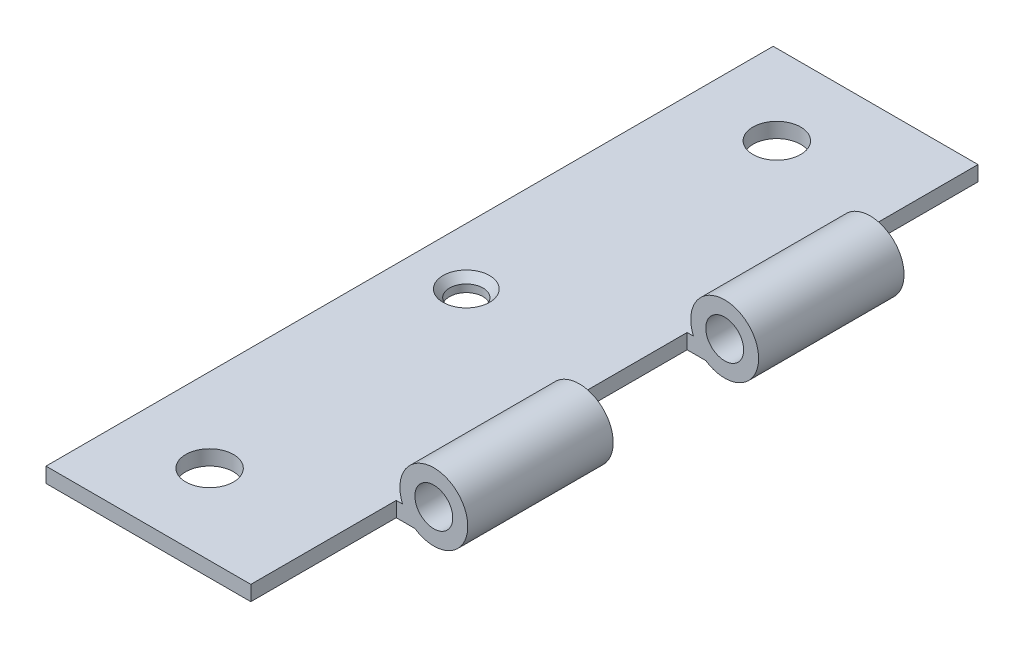
ISO-10303-21;
HEADER;
FILE_DESCRIPTION(('STEP AP214'),'2;1');
FILE_NAME('part.step','',(''),(''),'','','');
FILE_SCHEMA(('AUTOMOTIVE_DESIGN { 1 0 10303 214 1 1 1 1 }'));
ENDSEC;
DATA;
#1=APPLICATION_CONTEXT('core data for automotive mechanical design processes');
#2=APPLICATION_PROTOCOL_DEFINITION('international standard','automotive_design',2000,#1);
#3=PRODUCT_CONTEXT('',#1,'mechanical');
#4=PRODUCT('Part','Part','',(#3));
#5=PRODUCT_RELATED_PRODUCT_CATEGORY('part','',(#4));
#6=PRODUCT_DEFINITION_FORMATION('','',#4);
#7=PRODUCT_DEFINITION_CONTEXT('part definition',#1,'design');
#8=PRODUCT_DEFINITION('design','',#6,#7);
#9=PRODUCT_DEFINITION_SHAPE('','',#8);
#10=(LENGTH_UNIT() NAMED_UNIT(*) SI_UNIT(.MILLI.,.METRE.));
#11=(NAMED_UNIT(*) PLANE_ANGLE_UNIT() SI_UNIT($,.RADIAN.));
#12=(NAMED_UNIT(*) SI_UNIT($,.STERADIAN.) SOLID_ANGLE_UNIT());
#13=UNCERTAINTY_MEASURE_WITH_UNIT(LENGTH_MEASURE(1.E-05),#10,'distance_accuracy_value','');
#14=(GEOMETRIC_REPRESENTATION_CONTEXT(3) GLOBAL_UNCERTAINTY_ASSIGNED_CONTEXT((#13)) GLOBAL_UNIT_ASSIGNED_CONTEXT((#10,
#11,#12)) REPRESENTATION_CONTEXT('',''));
#15=CARTESIAN_POINT('',(0.,0.,0.));
#16=DIRECTION('',(0.,0.,1.));
#17=DIRECTION('',(1.,0.,0.));
#18=AXIS2_PLACEMENT_3D('',#15,#16,#17);
#19=CARTESIAN_POINT('',(0.,0.,-22.86));
#20=DIRECTION('',(0.,0.,1.));
#21=DIRECTION('',(1.,0.,0.));
#22=AXIS2_PLACEMENT_3D('',#19,#20,#21);
#23=PLANE('',#22);
#24=CARTESIAN_POINT('',(0.,0.,-22.86));
#25=DIRECTION('',(0.,0.,-1.));
#26=DIRECTION('',(-1.,0.,0.));
#27=AXIS2_PLACEMENT_3D('',#24,#25,#26);
#28=CIRCLE('',#27,1.98437499999999);
#29=CARTESIAN_POINT('',(-1.98437499999999,0.,-22.86));
#30=VERTEX_POINT('',#29);
#31=EDGE_CURVE('E246',#30,#30,#28,.T.);
#32=ORIENTED_EDGE('',*,*,#31,.F.);
#33=EDGE_LOOP('',(#32));
#34=FACE_BOUND('',#33,.T.);
#35=DIRECTION('',(0.,-1.,0.));
#36=VECTOR('',#35,1.);
#37=CARTESIAN_POINT('',(-3.937,-2.95082901222268,-22.86));
#38=LINE('',#37,#36);
#39=CARTESIAN_POINT('',(-3.937,-1.37602901222267,-22.86));
#40=VERTEX_POINT('',#39);
#41=CARTESIAN_POINT('',(-3.937,-2.95082901222268,-22.86));
#42=VERTEX_POINT('',#41);
#43=EDGE_CURVE('E49',#40,#42,#38,.T.);
#44=ORIENTED_EDGE('',*,*,#43,.F.);
#45=DIRECTION('',(1.,0.,0.));
#46=VECTOR('',#45,1.);
#47=CARTESIAN_POINT('',(-3.53362245835359,-1.37602901222267,-22.86));
#48=LINE('',#47,#46);
#49=CARTESIAN_POINT('',(-3.27897547376029,-1.37602901222267,-22.86));
#50=VERTEX_POINT('',#49);
#51=EDGE_CURVE('E145',#40,#50,#48,.T.);
#52=ORIENTED_EDGE('',*,*,#51,.T.);
#53=CARTESIAN_POINT('',(0.,0.,-22.86));
#54=DIRECTION('',(0.,0.,1.));
#55=DIRECTION('',(1.,0.,0.));
#56=AXIS2_PLACEMENT_3D('',#53,#54,#55);
#57=CIRCLE('',#56,3.556);
#58=CARTESIAN_POINT('',(-1.984375,-2.95082901222266,-22.86));
#59=VERTEX_POINT('',#58);
#60=EDGE_CURVE('E194',#59,#50,#57,.T.);
#61=ORIENTED_EDGE('',*,*,#60,.F.);
#62=DIRECTION('',(1.,0.,0.));
#63=VECTOR('',#62,1.);
#64=CARTESIAN_POINT('',(-3.27897547376029,-2.95082901222268,-22.86));
#65=LINE('',#64,#63);
#66=EDGE_CURVE('E192',#42,#59,#65,.T.);
#67=ORIENTED_EDGE('',*,*,#66,.F.);
#68=EDGE_LOOP('',(#44,#52,#61,#67));
#69=FACE_BOUND('',#68,.T.);
#70=ADVANCED_FACE('F32',(#34,#69),#23,.F.);
#71=CARTESIAN_POINT('',(0.,0.,22.86));
#72=DIRECTION('',(0.,0.,-1.));
#73=DIRECTION('',(-1.,0.,0.));
#74=AXIS2_PLACEMENT_3D('',#71,#72,#73);
#75=PLANE('',#74);
#76=CARTESIAN_POINT('',(0.,0.,22.86));
#77=DIRECTION('',(0.,0.,-1.));
#78=DIRECTION('',(-1.,0.,0.));
#79=AXIS2_PLACEMENT_3D('',#76,#77,#78);
#80=CIRCLE('',#79,1.98437499999999);
#81=CARTESIAN_POINT('',(-1.98437499999999,0.,22.86));
#82=VERTEX_POINT('',#81);
#83=EDGE_CURVE('E156',#82,#82,#80,.T.);
#84=ORIENTED_EDGE('',*,*,#83,.T.);
#85=EDGE_LOOP('',(#84));
#86=FACE_BOUND('',#85,.T.);
#87=DIRECTION('',(0.,1.,0.));
#88=VECTOR('',#87,1.);
#89=CARTESIAN_POINT('',(-3.937,-1.37602901222267,22.86));
#90=LINE('',#89,#88);
#91=CARTESIAN_POINT('',(-3.937,-2.95082901222267,22.86));
#92=VERTEX_POINT('',#91);
#93=CARTESIAN_POINT('',(-3.937,-1.37602901222267,22.86));
#94=VERTEX_POINT('',#93);
#95=EDGE_CURVE('E57',#92,#94,#90,.T.);
#96=ORIENTED_EDGE('',*,*,#95,.F.);
#97=DIRECTION('',(1.,0.,0.));
#98=VECTOR('',#97,1.);
#99=CARTESIAN_POINT('',(-1.984375,-2.95082901222266,22.86));
#100=LINE('',#99,#98);
#101=CARTESIAN_POINT('',(-1.984375,-2.95082901222267,22.86));
#102=VERTEX_POINT('',#101);
#103=EDGE_CURVE('E535',#92,#102,#100,.T.);
#104=ORIENTED_EDGE('',*,*,#103,.T.);
#105=CARTESIAN_POINT('',(0.,0.,22.86));
#106=DIRECTION('',(0.,0.,1.));
#107=DIRECTION('',(-1.,0.,0.));
#108=AXIS2_PLACEMENT_3D('',#105,#106,#107);
#109=CIRCLE('',#108,3.556);
#110=CARTESIAN_POINT('',(-3.27897547376029,-1.37602901222267,22.86));
#111=VERTEX_POINT('',#110);
#112=EDGE_CURVE('E536',#102,#111,#109,.T.);
#113=ORIENTED_EDGE('',*,*,#112,.T.);
#114=DIRECTION('',(-1.,0.,0.));
#115=VECTOR('',#114,1.);
#116=CARTESIAN_POINT('',(-25.4,-1.37602901222267,22.86));
#117=LINE('',#116,#115);
#118=EDGE_CURVE('E180',#111,#94,#117,.T.);
#119=ORIENTED_EDGE('',*,*,#118,.T.);
#120=EDGE_LOOP('',(#96,#104,#113,#119));
#121=FACE_BOUND('',#120,.T.);
#122=ADVANCED_FACE('F297',(#86,#121),#75,.F.);
#123=CARTESIAN_POINT('',(0.,0.,-22.86));
#124=DIRECTION('',(0.,0.,1.));
#125=DIRECTION('',(1.,0.,0.));
#126=AXIS2_PLACEMENT_3D('',#123,#124,#125);
#127=CYLINDRICAL_SURFACE('',#126,3.556);
#128=CARTESIAN_POINT('',(0.,0.,-7.62));
#129=DIRECTION('',(0.,0.,1.));
#130=DIRECTION('',(1.,0.,0.));
#131=AXIS2_PLACEMENT_3D('',#128,#129,#130);
#132=CIRCLE('',#131,3.556);
#133=CARTESIAN_POINT('',(-1.984375,-2.95082901222266,-7.62));
#134=VERTEX_POINT('',#133);
#135=CARTESIAN_POINT('',(-3.27897547376029,-1.37602901222267,-7.61999999999999));
#136=VERTEX_POINT('',#135);
#137=EDGE_CURVE('E198',#134,#136,#132,.T.);
#138=ORIENTED_EDGE('',*,*,#137,.F.);
#139=DIRECTION('',(0.,0.,1.));
#140=VECTOR('',#139,1.);
#141=CARTESIAN_POINT('',(-1.984375,-2.95082901222266,-22.86));
#142=LINE('',#141,#140);
#143=EDGE_CURVE('E11',#59,#134,#142,.T.);
#144=ORIENTED_EDGE('',*,*,#143,.F.);
#145=ORIENTED_EDGE('',*,*,#60,.T.);
#146=DIRECTION('',(0.,0.,1.));
#147=VECTOR('',#146,1.);
#148=CARTESIAN_POINT('',(-3.27897547376029,-1.37602901222267,-22.86));
#149=LINE('',#148,#147);
#150=EDGE_CURVE('E41',#50,#136,#149,.T.);
#151=ORIENTED_EDGE('',*,*,#150,.T.);
#152=EDGE_LOOP('',(#138,#144,#145,#151));
#153=FACE_BOUND('',#152,.T.);
#154=ADVANCED_FACE('F34',(#153),#127,.T.);
#155=CARTESIAN_POINT('',(-3.27897547376029,-2.95082901222268,-22.86));
#156=DIRECTION('',(0.,-1.,0.));
#157=DIRECTION('',(1.,0.,0.));
#158=AXIS2_PLACEMENT_3D('',#155,#156,#157);
#159=PLANE('',#158);
#160=CARTESIAN_POINT('',(-16.637,-2.95082901222278,29.718));
#161=DIRECTION('',(0.,-1.,0.));
#162=DIRECTION('',(1.,0.,0.));
#163=AXIS2_PLACEMENT_3D('',#160,#161,#162);
#164=CIRCLE('',#163,2.5);
#165=CARTESIAN_POINT('',(-14.137,-2.95082901222276,29.718));
#166=VERTEX_POINT('',#165);
#167=EDGE_CURVE('E261',#166,#166,#164,.F.);
#168=ORIENTED_EDGE('',*,*,#167,.T.);
#169=EDGE_LOOP('',(#168));
#170=FACE_BOUND('',#169,.T.);
#171=CARTESIAN_POINT('',(-16.637,-2.95082901222278,-29.718));
#172=DIRECTION('',(0.,-1.,0.));
#173=DIRECTION('',(1.,0.,0.));
#174=AXIS2_PLACEMENT_3D('',#171,#172,#173);
#175=CIRCLE('',#174,2.5);
#176=CARTESIAN_POINT('',(-14.137,-2.95082901222276,-29.718));
#177=VERTEX_POINT('',#176);
#178=EDGE_CURVE('E255',#177,#177,#175,.F.);
#179=ORIENTED_EDGE('',*,*,#178,.T.);
#180=EDGE_LOOP('',(#179));
#181=FACE_BOUND('',#180,.T.);
#182=CARTESIAN_POINT('',(-19.4564,-2.9508290122228,0.));
#183=DIRECTION('',(0.,-1.,0.));
#184=DIRECTION('',(1.,0.,0.));
#185=AXIS2_PLACEMENT_3D('',#182,#183,#184);
#186=CIRCLE('',#185,1.75259999999999);
#187=CARTESIAN_POINT('',(-17.7038,-2.95082901222279,0.));
#188=VERTEX_POINT('',#187);
#189=EDGE_CURVE('E36',#188,#188,#186,.T.);
#190=ORIENTED_EDGE('',*,*,#189,.F.);
#191=EDGE_LOOP('',(#190));
#192=FACE_BOUND('',#191,.T.);
#193=DIRECTION('',(1.,0.,0.));
#194=VECTOR('',#193,1.);
#195=CARTESIAN_POINT('',(-3.27897547376029,-2.95082901222268,-7.62));
#196=LINE('',#195,#194);
#197=CARTESIAN_POINT('',(-3.937,-2.95082901222268,-7.62));
#198=VERTEX_POINT('',#197);
#199=EDGE_CURVE('E201',#198,#134,#196,.T.);
#200=ORIENTED_EDGE('',*,*,#199,.F.);
#201=DIRECTION('',(0.,0.,-1.));
#202=VECTOR('',#201,1.);
#203=CARTESIAN_POINT('',(-3.937,-2.95082901222268,7.62));
#204=LINE('',#203,#202);
#205=CARTESIAN_POINT('',(-3.937,-2.95082901222268,7.62));
#206=VERTEX_POINT('',#205);
#207=EDGE_CURVE('E210',#206,#198,#204,.T.);
#208=ORIENTED_EDGE('',*,*,#207,.F.);
#209=DIRECTION('',(1.,0.,0.));
#210=VECTOR('',#209,1.);
#211=CARTESIAN_POINT('',(-1.984375,-2.95082901222266,7.62));
#212=LINE('',#211,#210);
#213=CARTESIAN_POINT('',(-1.984375,-2.95082901222267,7.62));
#214=VERTEX_POINT('',#213);
#215=EDGE_CURVE('E190',#206,#214,#212,.T.);
#216=ORIENTED_EDGE('',*,*,#215,.T.);
#217=DIRECTION('',(0.,0.,-1.));
#218=VECTOR('',#217,1.);
#219=CARTESIAN_POINT('',(-1.984375,-2.95082901222267,22.86));
#220=LINE('',#219,#218);
#221=EDGE_CURVE('E527',#102,#214,#220,.T.);
#222=ORIENTED_EDGE('',*,*,#221,.F.);
#223=ORIENTED_EDGE('',*,*,#103,.F.);
#224=DIRECTION('',(0.,0.,-1.));
#225=VECTOR('',#224,1.);
#226=CARTESIAN_POINT('',(-3.937,-2.95082901222268,38.1));
#227=LINE('',#226,#225);
#228=CARTESIAN_POINT('',(-3.937,-2.95082901222268,38.1));
#229=VERTEX_POINT('',#228);
#230=EDGE_CURVE('E185',#229,#92,#227,.T.);
#231=ORIENTED_EDGE('',*,*,#230,.F.);
#232=DIRECTION('',(1.,0.,0.));
#233=VECTOR('',#232,1.);
#234=CARTESIAN_POINT('',(-3.937,-2.95082901222268,38.1));
#235=LINE('',#234,#233);
#236=CARTESIAN_POINT('',(-25.4,-2.95082901222268,38.1));
#237=VERTEX_POINT('',#236);
#238=EDGE_CURVE('E147',#237,#229,#235,.T.);
#239=ORIENTED_EDGE('',*,*,#238,.F.);
#240=DIRECTION('',(0.,0.,1.));
#241=VECTOR('',#240,1.);
#242=CARTESIAN_POINT('',(-25.4,-2.95082901222268,7.62));
#243=LINE('',#242,#241);
#244=CARTESIAN_POINT('',(-25.4,-2.95082901222268,-38.1));
#245=VERTEX_POINT('',#244);
#246=EDGE_CURVE('E223',#245,#237,#243,.T.);
#247=ORIENTED_EDGE('',*,*,#246,.F.);
#248=DIRECTION('',(-1.,0.,0.));
#249=VECTOR('',#248,1.);
#250=CARTESIAN_POINT('',(-25.4,-2.95082901222268,-38.1));
#251=LINE('',#250,#249);
#252=CARTESIAN_POINT('',(-3.937,-2.95082901222268,-38.1));
#253=VERTEX_POINT('',#252);
#254=EDGE_CURVE('E132',#253,#245,#251,.T.);
#255=ORIENTED_EDGE('',*,*,#254,.F.);
#256=DIRECTION('',(0.,0.,1.));
#257=VECTOR('',#256,1.);
#258=CARTESIAN_POINT('',(-3.937,-2.95082901222268,-38.1));
#259=LINE('',#258,#257);
#260=EDGE_CURVE('E128',#253,#42,#259,.T.);
#261=ORIENTED_EDGE('',*,*,#260,.T.);
#262=ORIENTED_EDGE('',*,*,#66,.T.);
#263=ORIENTED_EDGE('',*,*,#143,.T.);
#264=EDGE_LOOP('',(#200,#208,#216,#222,#223,#231,#239,#247,#255,#261,#262,#263));
#265=FACE_BOUND('',#264,.T.);
#266=ADVANCED_FACE('F233',(#170,#181,#192,#265),#159,.T.);
#267=CARTESIAN_POINT('',(0.,0.,-7.62));
#268=DIRECTION('',(0.,0.,1.));
#269=DIRECTION('',(1.,0.,0.));
#270=AXIS2_PLACEMENT_3D('',#267,#268,#269);
#271=PLANE('',#270);
#272=CARTESIAN_POINT('',(0.,0.,-7.62));
#273=DIRECTION('',(0.,0.,1.));
#274=DIRECTION('',(1.,0.,0.));
#275=AXIS2_PLACEMENT_3D('',#272,#273,#274);
#276=CIRCLE('',#275,1.98437499999998);
#277=CARTESIAN_POINT('',(1.98437499999998,0.,-7.62));
#278=VERTEX_POINT('',#277);
#279=EDGE_CURVE('E243',#278,#278,#276,.T.);
#280=ORIENTED_EDGE('',*,*,#279,.F.);
#281=EDGE_LOOP('',(#280));
#282=FACE_BOUND('',#281,.T.);
#283=ORIENTED_EDGE('',*,*,#137,.T.);
#284=DIRECTION('',(1.,0.,0.));
#285=VECTOR('',#284,1.);
#286=CARTESIAN_POINT('',(-3.53362245835359,-1.37602901222267,-7.61999999999999));
#287=LINE('',#286,#285);
#288=CARTESIAN_POINT('',(-3.937,-1.37602901222267,-7.62));
#289=VERTEX_POINT('',#288);
#290=EDGE_CURVE('E225',#289,#136,#287,.T.);
#291=ORIENTED_EDGE('',*,*,#290,.F.);
#292=DIRECTION('',(0.,1.,0.));
#293=VECTOR('',#292,1.);
#294=CARTESIAN_POINT('',(-3.937,-2.95082901222268,-7.62));
#295=LINE('',#294,#293);
#296=EDGE_CURVE('E218',#198,#289,#295,.T.);
#297=ORIENTED_EDGE('',*,*,#296,.F.);
#298=ORIENTED_EDGE('',*,*,#199,.T.);
#299=EDGE_LOOP('',(#283,#291,#297,#298));
#300=FACE_BOUND('',#299,.T.);
#301=ADVANCED_FACE('F274',(#282,#300),#271,.T.);
#302=CARTESIAN_POINT('',(-3.53362245835359,-1.37602901222267,-22.86));
#303=DIRECTION('',(0.,-1.,0.));
#304=DIRECTION('',(0.,0.,-1.));
#305=AXIS2_PLACEMENT_3D('',#302,#303,#304);
#306=PLANE('',#305);
#307=CARTESIAN_POINT('',(-16.637,-1.37602901222268,29.718));
#308=DIRECTION('',(0.,1.,0.));
#309=DIRECTION('',(0.,0.,1.));
#310=AXIS2_PLACEMENT_3D('',#307,#308,#309);
#311=CIRCLE('',#310,2.5);
#312=CARTESIAN_POINT('',(-16.637,-1.37602901222268,32.218));
#313=VERTEX_POINT('',#312);
#314=EDGE_CURVE('E264',#313,#313,#311,.T.);
#315=ORIENTED_EDGE('',*,*,#314,.F.);
#316=EDGE_LOOP('',(#315));
#317=FACE_BOUND('',#316,.T.);
#318=CARTESIAN_POINT('',(-16.637,-1.37602901222267,-29.718));
#319=DIRECTION('',(0.,1.,0.));
#320=DIRECTION('',(0.,0.,1.));
#321=AXIS2_PLACEMENT_3D('',#318,#319,#320);
#322=CIRCLE('',#321,2.5);
#323=CARTESIAN_POINT('',(-16.637,-1.37602901222267,-27.218));
#324=VERTEX_POINT('',#323);
#325=EDGE_CURVE('E258',#324,#324,#322,.T.);
#326=ORIENTED_EDGE('',*,*,#325,.F.);
#327=EDGE_LOOP('',(#326));
#328=FACE_BOUND('',#327,.T.);
#329=CARTESIAN_POINT('',(-19.4564,-1.37602901222267,0.));
#330=DIRECTION('',(0.,1.,0.));
#331=DIRECTION('',(0.,0.,1.));
#332=AXIS2_PLACEMENT_3D('',#329,#330,#331);
#333=CIRCLE('',#332,2.4370763773565);
#334=CARTESIAN_POINT('',(-19.4564,-1.37602901222267,2.4370763773565));
#335=VERTEX_POINT('',#334);
#336=EDGE_CURVE('E252',#335,#335,#333,.T.);
#337=ORIENTED_EDGE('',*,*,#336,.F.);
#338=EDGE_LOOP('',(#337));
#339=FACE_BOUND('',#338,.T.);
#340=DIRECTION('',(0.,0.,1.));
#341=VECTOR('',#340,1.);
#342=CARTESIAN_POINT('',(-3.937,-1.37602901222267,-7.62));
#343=LINE('',#342,#341);
#344=CARTESIAN_POINT('',(-3.937,-1.37602901222267,7.62));
#345=VERTEX_POINT('',#344);
#346=EDGE_CURVE('E211',#289,#345,#343,.T.);
#347=ORIENTED_EDGE('',*,*,#346,.F.);
#348=ORIENTED_EDGE('',*,*,#290,.T.);
#349=ORIENTED_EDGE('',*,*,#150,.F.);
#350=ORIENTED_EDGE('',*,*,#51,.F.);
#351=DIRECTION('',(0.,0.,1.));
#352=VECTOR('',#351,1.);
#353=CARTESIAN_POINT('',(-3.937,-1.37602901222267,-38.1));
#354=LINE('',#353,#352);
#355=CARTESIAN_POINT('',(-3.937,-1.37602901222267,-38.1));
#356=VERTEX_POINT('',#355);
#357=EDGE_CURVE('E126',#356,#40,#354,.T.);
#358=ORIENTED_EDGE('',*,*,#357,.F.);
#359=DIRECTION('',(1.,0.,0.));
#360=VECTOR('',#359,1.);
#361=CARTESIAN_POINT('',(-3.937,-1.37602901222267,-38.1));
#362=LINE('',#361,#360);
#363=CARTESIAN_POINT('',(-25.4,-1.37602901222267,-38.1));
#364=VERTEX_POINT('',#363);
#365=EDGE_CURVE('E133',#364,#356,#362,.T.);
#366=ORIENTED_EDGE('',*,*,#365,.F.);
#367=DIRECTION('',(0.,0.,-1.));
#368=VECTOR('',#367,1.);
#369=CARTESIAN_POINT('',(-25.4,-1.37602901222267,-22.86));
#370=LINE('',#369,#368);
#371=CARTESIAN_POINT('',(-25.4,-1.37602901222267,38.1));
#372=VERTEX_POINT('',#371);
#373=EDGE_CURVE('E221',#372,#364,#370,.T.);
#374=ORIENTED_EDGE('',*,*,#373,.F.);
#375=DIRECTION('',(-1.,0.,0.));
#376=VECTOR('',#375,1.);
#377=CARTESIAN_POINT('',(-25.4,-1.37602901222267,38.1));
#378=LINE('',#377,#376);
#379=CARTESIAN_POINT('',(-3.937,-1.37602901222267,38.1));
#380=VERTEX_POINT('',#379);
#381=EDGE_CURVE('E167',#380,#372,#378,.T.);
#382=ORIENTED_EDGE('',*,*,#381,.F.);
#383=DIRECTION('',(0.,0.,-1.));
#384=VECTOR('',#383,1.);
#385=CARTESIAN_POINT('',(-3.937,-1.37602901222267,38.1));
#386=LINE('',#385,#384);
#387=EDGE_CURVE('E173',#380,#94,#386,.T.);
#388=ORIENTED_EDGE('',*,*,#387,.T.);
#389=ORIENTED_EDGE('',*,*,#118,.F.);
#390=DIRECTION('',(0.,0.,-1.));
#391=VECTOR('',#390,1.);
#392=CARTESIAN_POINT('',(-3.27897547376029,-1.37602901222267,22.86));
#393=LINE('',#392,#391);
#394=CARTESIAN_POINT('',(-3.27897547376029,-1.37602901222267,7.62));
#395=VERTEX_POINT('',#394);
#396=EDGE_CURVE('E530',#111,#395,#393,.T.);
#397=ORIENTED_EDGE('',*,*,#396,.T.);
#398=DIRECTION('',(-1.,0.,0.));
#399=VECTOR('',#398,1.);
#400=CARTESIAN_POINT('',(-25.4,-1.37602901222267,7.62));
#401=LINE('',#400,#399);
#402=EDGE_CURVE('E526',#395,#345,#401,.T.);
#403=ORIENTED_EDGE('',*,*,#402,.T.);
#404=EDGE_LOOP('',(#347,#348,#349,#350,#358,#366,#374,#382,#388,#389,#397,#403));
#405=FACE_BOUND('',#404,.T.);
#406=ADVANCED_FACE('F143',(#317,#328,#339,#405),#306,.F.);
#407=CARTESIAN_POINT('',(-25.4,0.,0.));
#408=DIRECTION('',(1.,0.,0.));
#409=DIRECTION('',(0.,0.,-1.));
#410=AXIS2_PLACEMENT_3D('',#407,#408,#409);
#411=PLANE('',#410);
#412=ORIENTED_EDGE('',*,*,#373,.T.);
#413=DIRECTION('',(0.,1.,0.));
#414=VECTOR('',#413,1.);
#415=CARTESIAN_POINT('',(-25.4,-1.37602901222267,-38.1));
#416=LINE('',#415,#414);
#417=EDGE_CURVE('E139',#245,#364,#416,.T.);
#418=ORIENTED_EDGE('',*,*,#417,.F.);
#419=ORIENTED_EDGE('',*,*,#246,.T.);
#420=DIRECTION('',(0.,-1.,0.));
#421=VECTOR('',#420,1.);
#422=CARTESIAN_POINT('',(-25.4,-2.95082901222268,38.1));
#423=LINE('',#422,#421);
#424=EDGE_CURVE('E170',#372,#237,#423,.T.);
#425=ORIENTED_EDGE('',*,*,#424,.F.);
#426=EDGE_LOOP('',(#412,#418,#419,#425));
#427=FACE_BOUND('',#426,.T.);
#428=ADVANCED_FACE('F273',(#427),#411,.F.);
#429=CARTESIAN_POINT('',(-3.937,0.,0.));
#430=DIRECTION('',(1.,0.,0.));
#431=DIRECTION('',(0.,0.,-1.));
#432=AXIS2_PLACEMENT_3D('',#429,#430,#431);
#433=PLANE('',#432);
#434=ORIENTED_EDGE('',*,*,#346,.T.);
#435=DIRECTION('',(0.,-1.,0.));
#436=VECTOR('',#435,1.);
#437=CARTESIAN_POINT('',(-3.937,-1.37602901222267,7.62));
#438=LINE('',#437,#436);
#439=EDGE_CURVE('E206',#345,#206,#438,.T.);
#440=ORIENTED_EDGE('',*,*,#439,.T.);
#441=ORIENTED_EDGE('',*,*,#207,.T.);
#442=ORIENTED_EDGE('',*,*,#296,.T.);
#443=EDGE_LOOP('',(#434,#440,#441,#442));
#444=FACE_BOUND('',#443,.T.);
#445=ADVANCED_FACE('F351',(#444),#433,.T.);
#446=CARTESIAN_POINT('',(0.,0.,7.62));
#447=DIRECTION('',(0.,0.,-1.));
#448=DIRECTION('',(-1.,0.,0.));
#449=AXIS2_PLACEMENT_3D('',#446,#447,#448);
#450=PLANE('',#449);
#451=CARTESIAN_POINT('',(0.,0.,7.62));
#452=DIRECTION('',(0.,0.,-1.));
#453=DIRECTION('',(-1.,0.,0.));
#454=AXIS2_PLACEMENT_3D('',#451,#452,#453);
#455=CIRCLE('',#454,1.98437499999999);
#456=CARTESIAN_POINT('',(-1.98437499999999,0.,7.62));
#457=VERTEX_POINT('',#456);
#458=EDGE_CURVE('E240',#457,#457,#455,.T.);
#459=ORIENTED_EDGE('',*,*,#458,.F.);
#460=EDGE_LOOP('',(#459));
#461=FACE_BOUND('',#460,.T.);
#462=ORIENTED_EDGE('',*,*,#439,.F.);
#463=ORIENTED_EDGE('',*,*,#402,.F.);
#464=CARTESIAN_POINT('',(0.,0.,7.62));
#465=DIRECTION('',(0.,0.,1.));
#466=DIRECTION('',(-1.,0.,0.));
#467=AXIS2_PLACEMENT_3D('',#464,#465,#466);
#468=CIRCLE('',#467,3.556);
#469=EDGE_CURVE('E538',#214,#395,#468,.T.);
#470=ORIENTED_EDGE('',*,*,#469,.F.);
#471=ORIENTED_EDGE('',*,*,#215,.F.);
#472=EDGE_LOOP('',(#462,#463,#470,#471));
#473=FACE_BOUND('',#472,.T.);
#474=ADVANCED_FACE('F359',(#461,#473),#450,.T.);
#475=CARTESIAN_POINT('',(0.,0.,22.86));
#476=DIRECTION('',(0.,0.,-1.));
#477=DIRECTION('',(-1.,0.,0.));
#478=AXIS2_PLACEMENT_3D('',#475,#476,#477);
#479=CYLINDRICAL_SURFACE('',#478,3.556);
#480=ORIENTED_EDGE('',*,*,#469,.T.);
#481=ORIENTED_EDGE('',*,*,#396,.F.);
#482=ORIENTED_EDGE('',*,*,#112,.F.);
#483=ORIENTED_EDGE('',*,*,#221,.T.);
#484=EDGE_LOOP('',(#480,#481,#482,#483));
#485=FACE_BOUND('',#484,.T.);
#486=ADVANCED_FACE('F369',(#485),#479,.T.);
#487=CARTESIAN_POINT('',(-3.937,-1.37602901222267,38.1));
#488=DIRECTION('',(-1.,0.,0.));
#489=DIRECTION('',(0.,0.,1.));
#490=AXIS2_PLACEMENT_3D('',#487,#488,#489);
#491=PLANE('',#490);
#492=ORIENTED_EDGE('',*,*,#95,.T.);
#493=ORIENTED_EDGE('',*,*,#387,.F.);
#494=DIRECTION('',(0.,1.,0.));
#495=VECTOR('',#494,1.);
#496=CARTESIAN_POINT('',(-3.937,-1.37602901222267,38.1));
#497=LINE('',#496,#495);
#498=EDGE_CURVE('E165',#229,#380,#497,.T.);
#499=ORIENTED_EDGE('',*,*,#498,.F.);
#500=ORIENTED_EDGE('',*,*,#230,.T.);
#501=EDGE_LOOP('',(#492,#493,#499,#500));
#502=FACE_BOUND('',#501,.T.);
#503=ADVANCED_FACE('F378',(#502),#491,.F.);
#504=CARTESIAN_POINT('',(0.,0.,38.1));
#505=DIRECTION('',(0.,0.,-1.));
#506=DIRECTION('',(-1.,0.,0.));
#507=AXIS2_PLACEMENT_3D('',#504,#505,#506);
#508=PLANE('',#507);
#509=ORIENTED_EDGE('',*,*,#238,.T.);
#510=ORIENTED_EDGE('',*,*,#498,.T.);
#511=ORIENTED_EDGE('',*,*,#381,.T.);
#512=ORIENTED_EDGE('',*,*,#424,.T.);
#513=EDGE_LOOP('',(#509,#510,#511,#512));
#514=FACE_BOUND('',#513,.T.);
#515=ADVANCED_FACE('F386',(#514),#508,.F.);
#516=CARTESIAN_POINT('',(-3.937,-2.95082901222268,-38.1));
#517=DIRECTION('',(-1.,0.,0.));
#518=DIRECTION('',(0.,0.,1.));
#519=AXIS2_PLACEMENT_3D('',#516,#517,#518);
#520=PLANE('',#519);
#521=ORIENTED_EDGE('',*,*,#43,.T.);
#522=ORIENTED_EDGE('',*,*,#260,.F.);
#523=DIRECTION('',(0.,-1.,0.));
#524=VECTOR('',#523,1.);
#525=CARTESIAN_POINT('',(-3.937,-2.95082901222268,-38.1));
#526=LINE('',#525,#524);
#527=EDGE_CURVE('E122',#356,#253,#526,.T.);
#528=ORIENTED_EDGE('',*,*,#527,.F.);
#529=ORIENTED_EDGE('',*,*,#357,.T.);
#530=EDGE_LOOP('',(#521,#522,#528,#529));
#531=FACE_BOUND('',#530,.T.);
#532=ADVANCED_FACE('F124',(#531),#520,.F.);
#533=CARTESIAN_POINT('',(0.,0.,-38.1));
#534=DIRECTION('',(0.,0.,1.));
#535=DIRECTION('',(1.,0.,0.));
#536=AXIS2_PLACEMENT_3D('',#533,#534,#535);
#537=PLANE('',#536);
#538=ORIENTED_EDGE('',*,*,#365,.T.);
#539=ORIENTED_EDGE('',*,*,#527,.T.);
#540=ORIENTED_EDGE('',*,*,#254,.T.);
#541=ORIENTED_EDGE('',*,*,#417,.T.);
#542=EDGE_LOOP('',(#538,#539,#540,#541));
#543=FACE_BOUND('',#542,.T.);
#544=ADVANCED_FACE('F137',(#543),#537,.F.);
#545=CARTESIAN_POINT('',(0.,0.,7.62));
#546=DIRECTION('',(0.,0.,-1.));
#547=DIRECTION('',(-1.,0.,0.));
#548=AXIS2_PLACEMENT_3D('',#545,#546,#547);
#549=CYLINDRICAL_SURFACE('',#548,1.98437499999999);
#550=ORIENTED_EDGE('',*,*,#458,.T.);
#551=EDGE_LOOP('',(#550));
#552=FACE_BOUND('',#551,.T.);
#553=ORIENTED_EDGE('',*,*,#83,.F.);
#554=EDGE_LOOP('',(#553));
#555=FACE_BOUND('',#554,.T.);
#556=ADVANCED_FACE('F405',(#552,#555),#549,.F.);
#557=CARTESIAN_POINT('',(0.,0.,-22.86));
#558=DIRECTION('',(0.,0.,-1.));
#559=DIRECTION('',(-1.,0.,0.));
#560=AXIS2_PLACEMENT_3D('',#557,#558,#559);
#561=CYLINDRICAL_SURFACE('',#560,1.98437499999998);
#562=ORIENTED_EDGE('',*,*,#279,.T.);
#563=EDGE_LOOP('',(#562));
#564=FACE_BOUND('',#563,.T.);
#565=ORIENTED_EDGE('',*,*,#31,.T.);
#566=EDGE_LOOP('',(#565));
#567=FACE_BOUND('',#566,.T.);
#568=ADVANCED_FACE('F292',(#564,#567),#561,.F.);
#569=CARTESIAN_POINT('',(-19.4564,-1.37602901222267,0.));
#570=DIRECTION('',(0.,1.,0.));
#571=DIRECTION('',(0.,0.,1.));
#572=AXIS2_PLACEMENT_3D('',#569,#570,#571);
#573=CYLINDRICAL_SURFACE('',#572,1.75259999999999);
#574=ORIENTED_EDGE('',*,*,#189,.T.);
#575=EDGE_LOOP('',(#574));
#576=FACE_BOUND('',#575,.T.);
#577=CARTESIAN_POINT('',(-19.4564,-2.16342901222269,0.));
#578=DIRECTION('',(0.,1.,0.));
#579=DIRECTION('',(0.,0.,1.));
#580=AXIS2_PLACEMENT_3D('',#577,#578,#579);
#581=CIRCLE('',#580,1.75259999999999);
#582=CARTESIAN_POINT('',(-19.4564,-2.1634290122227,1.75259999999999));
#583=VERTEX_POINT('',#582);
#584=EDGE_CURVE('E249',#583,#583,#581,.T.);
#585=ORIENTED_EDGE('',*,*,#584,.T.);
#586=EDGE_LOOP('',(#585));
#587=FACE_BOUND('',#586,.T.);
#588=ADVANCED_FACE('F283',(#576,#587),#573,.F.);
#589=CARTESIAN_POINT('',(-19.4564,-1.37602901222267,0.));
#590=DIRECTION('',(0.,1.,0.));
#591=DIRECTION('',(0.,0.,1.));
#592=AXIS2_PLACEMENT_3D('',#589,#590,#591);
#593=CONICAL_SURFACE('',#592,2.4370763773565,0.71558499331767);
#594=ORIENTED_EDGE('',*,*,#584,.F.);
#595=EDGE_LOOP('',(#594));
#596=FACE_BOUND('',#595,.T.);
#597=ORIENTED_EDGE('',*,*,#336,.T.);
#598=EDGE_LOOP('',(#597));
#599=FACE_BOUND('',#598,.T.);
#600=ADVANCED_FACE('F280',(#596,#599),#593,.F.);
#601=CARTESIAN_POINT('',(-16.637,-10.0218968240883,-29.718));
#602=DIRECTION('',(0.,1.,0.));
#603=DIRECTION('',(0.,0.,1.));
#604=AXIS2_PLACEMENT_3D('',#601,#602,#603);
#605=CYLINDRICAL_SURFACE('',#604,2.5);
#606=ORIENTED_EDGE('',*,*,#325,.T.);
#607=EDGE_LOOP('',(#606));
#608=FACE_BOUND('',#607,.T.);
#609=ORIENTED_EDGE('',*,*,#178,.F.);
#610=EDGE_LOOP('',(#609));
#611=FACE_BOUND('',#610,.T.);
#612=ADVANCED_FACE('F282',(#608,#611),#605,.F.);
#613=CARTESIAN_POINT('',(-16.637,-10.0218968240883,29.718));
#614=DIRECTION('',(0.,1.,0.));
#615=DIRECTION('',(0.,0.,1.));
#616=AXIS2_PLACEMENT_3D('',#613,#614,#615);
#617=CYLINDRICAL_SURFACE('',#616,2.5);
#618=ORIENTED_EDGE('',*,*,#314,.T.);
#619=EDGE_LOOP('',(#618));
#620=FACE_BOUND('',#619,.T.);
#621=ORIENTED_EDGE('',*,*,#167,.F.);
#622=EDGE_LOOP('',(#621));
#623=FACE_BOUND('',#622,.T.);
#624=ADVANCED_FACE('F268',(#620,#623),#617,.F.);
#625=CLOSED_SHELL('',(#70,#122,#154,#266,#301,#406,#428,#445,#474,#486,#503,#515,#532,#544,#556,
#568,#588,#600,#612,#624));
#626=MANIFOLD_SOLID_BREP('B2',#625);
#627=ADVANCED_BREP_SHAPE_REPRESENTATION('',(#18,#626),#14);
#628=SHAPE_DEFINITION_REPRESENTATION(#9,#627);
ENDSEC;
END-ISO-10303-21;
